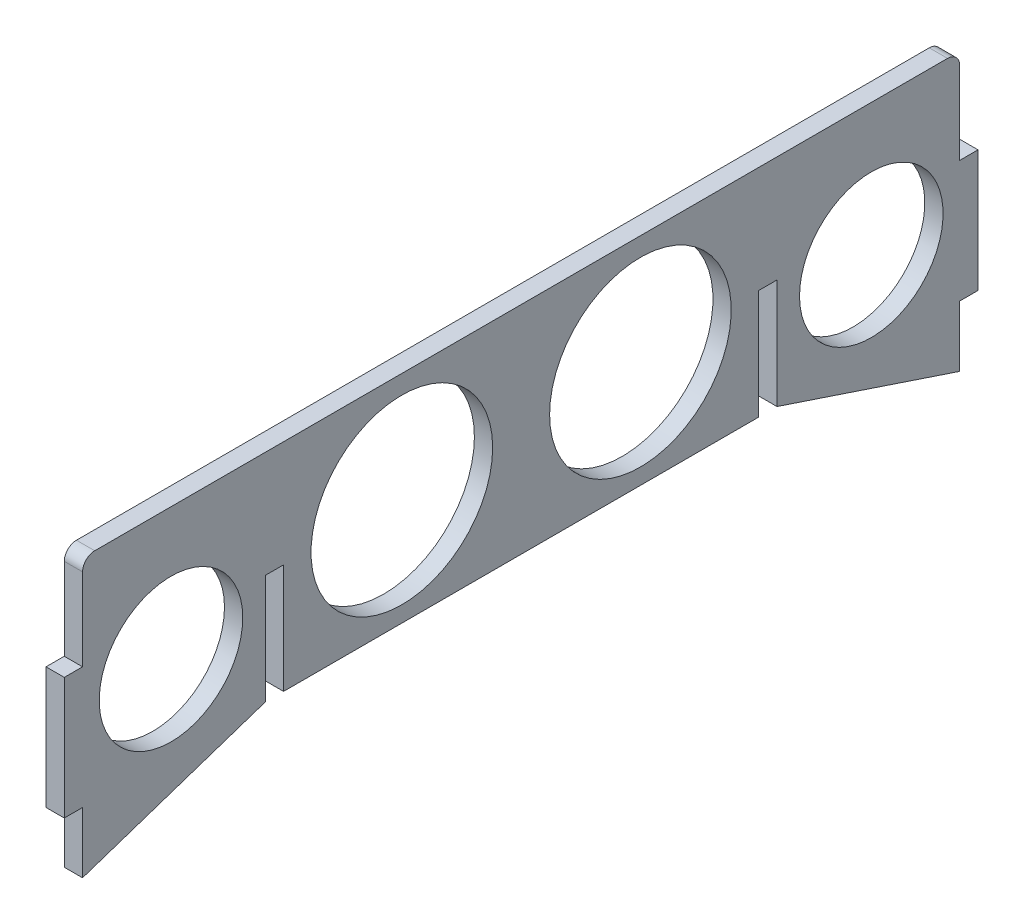
ISO-10303-21;
HEADER;
FILE_DESCRIPTION(('STEP AP214'),'2;1');
FILE_NAME('part.step','',(''),(''),'','','');
FILE_SCHEMA(('AUTOMOTIVE_DESIGN { 1 0 10303 214 1 1 1 1 }'));
ENDSEC;
DATA;
#1=APPLICATION_CONTEXT('core data for automotive mechanical design processes');
#2=APPLICATION_PROTOCOL_DEFINITION('international standard','automotive_design',2000,#1);
#3=PRODUCT_CONTEXT('',#1,'mechanical');
#4=PRODUCT('Part','Part','',(#3));
#5=PRODUCT_RELATED_PRODUCT_CATEGORY('part','',(#4));
#6=PRODUCT_DEFINITION_FORMATION('','',#4);
#7=PRODUCT_DEFINITION_CONTEXT('part definition',#1,'design');
#8=PRODUCT_DEFINITION('design','',#6,#7);
#9=PRODUCT_DEFINITION_SHAPE('','',#8);
#10=(LENGTH_UNIT() NAMED_UNIT(*) SI_UNIT(.MILLI.,.METRE.));
#11=(NAMED_UNIT(*) PLANE_ANGLE_UNIT() SI_UNIT($,.RADIAN.));
#12=(NAMED_UNIT(*) SI_UNIT($,.STERADIAN.) SOLID_ANGLE_UNIT());
#13=UNCERTAINTY_MEASURE_WITH_UNIT(LENGTH_MEASURE(1.E-05),#10,'distance_accuracy_value','');
#14=(GEOMETRIC_REPRESENTATION_CONTEXT(3) GLOBAL_UNCERTAINTY_ASSIGNED_CONTEXT((#13)) GLOBAL_UNIT_ASSIGNED_CONTEXT((#10,
#11,#12)) REPRESENTATION_CONTEXT('',''));
#15=CARTESIAN_POINT('',(0.,0.,0.));
#16=DIRECTION('',(0.,0.,1.));
#17=DIRECTION('',(1.,0.,0.));
#18=AXIS2_PLACEMENT_3D('',#15,#16,#17);
#19=CARTESIAN_POINT('',(3.,-17.75,-72.));
#20=DIRECTION('',(0.,0.,1.));
#21=DIRECTION('',(1.,0.,0.));
#22=AXIS2_PLACEMENT_3D('',#19,#20,#21);
#23=PLANE('',#22);
#24=DIRECTION('',(0.,1.,0.));
#25=VECTOR('',#24,1.);
#26=CARTESIAN_POINT('',(0.,-17.75,-72.));
#27=LINE('',#26,#25);
#28=CARTESIAN_POINT('',(0.,-27.75,-72.));
#29=VERTEX_POINT('',#28);
#30=CARTESIAN_POINT('',(0.,-17.75,-72.));
#31=VERTEX_POINT('',#30);
#32=EDGE_CURVE('E333',#29,#31,#27,.T.);
#33=ORIENTED_EDGE('',*,*,#32,.T.);
#34=DIRECTION('',(1.,0.,0.));
#35=VECTOR('',#34,1.);
#36=CARTESIAN_POINT('',(-20.2237484161567,-17.75,-72.));
#37=LINE('',#36,#35);
#38=CARTESIAN_POINT('',(3.,-17.75,-72.));
#39=VERTEX_POINT('',#38);
#40=EDGE_CURVE('E62',#31,#39,#37,.T.);
#41=ORIENTED_EDGE('',*,*,#40,.T.);
#42=DIRECTION('',(0.,1.,0.));
#43=VECTOR('',#42,1.);
#44=CARTESIAN_POINT('',(3.,-17.75,-72.));
#45=LINE('',#44,#43);
#46=CARTESIAN_POINT('',(3.,-27.75,-72.));
#47=VERTEX_POINT('',#46);
#48=EDGE_CURVE('E320',#47,#39,#45,.T.);
#49=ORIENTED_EDGE('',*,*,#48,.F.);
#50=DIRECTION('',(1.,0.,0.));
#51=VECTOR('',#50,1.);
#52=CARTESIAN_POINT('',(0.,-27.75,-72.));
#53=LINE('',#52,#51);
#54=EDGE_CURVE('E255',#29,#47,#53,.T.);
#55=ORIENTED_EDGE('',*,*,#54,.F.);
#56=EDGE_LOOP('',(#33,#41,#49,#55));
#57=FACE_BOUND('',#56,.T.);
#58=ADVANCED_FACE('F37',(#57),#23,.F.);
#59=CARTESIAN_POINT('',(3.,-17.75,72.));
#60=DIRECTION('',(0.,0.,-1.));
#61=DIRECTION('',(-1.,0.,0.));
#62=AXIS2_PLACEMENT_3D('',#59,#60,#61);
#63=PLANE('',#62);
#64=DIRECTION('',(0.,-1.,0.));
#65=VECTOR('',#64,1.);
#66=CARTESIAN_POINT('',(0.,-17.75,72.));
#67=LINE('',#66,#65);
#68=CARTESIAN_POINT('',(0.,15.75,72.));
#69=VERTEX_POINT('',#68);
#70=CARTESIAN_POINT('',(0.,2.25,72.));
#71=VERTEX_POINT('',#70);
#72=EDGE_CURVE('E339',#69,#71,#67,.T.);
#73=ORIENTED_EDGE('',*,*,#72,.T.);
#74=DIRECTION('',(1.,0.,0.));
#75=VECTOR('',#74,1.);
#76=CARTESIAN_POINT('',(-20.2237484161567,2.25,72.));
#77=LINE('',#76,#75);
#78=CARTESIAN_POINT('',(3.,2.25,72.));
#79=VERTEX_POINT('',#78);
#80=EDGE_CURVE('E248',#71,#79,#77,.T.);
#81=ORIENTED_EDGE('',*,*,#80,.T.);
#82=DIRECTION('',(0.,-1.,0.));
#83=VECTOR('',#82,1.);
#84=CARTESIAN_POINT('',(3.,-17.75,72.));
#85=LINE('',#84,#83);
#86=CARTESIAN_POINT('',(3.,15.75,72.));
#87=VERTEX_POINT('',#86);
#88=EDGE_CURVE('E326',#87,#79,#85,.T.);
#89=ORIENTED_EDGE('',*,*,#88,.F.);
#90=DIRECTION('',(-1.,0.,0.));
#91=VECTOR('',#90,1.);
#92=CARTESIAN_POINT('',(3.,15.75,72.));
#93=LINE('',#92,#91);
#94=EDGE_CURVE('E11',#87,#69,#93,.T.);
#95=ORIENTED_EDGE('',*,*,#94,.T.);
#96=EDGE_LOOP('',(#73,#81,#89,#95));
#97=FACE_BOUND('',#96,.T.);
#98=ADVANCED_FACE('F471',(#97),#63,.F.);
#99=CARTESIAN_POINT('',(3.,2.25,-72.));
#100=VERTEX_POINT('',#99);
#101=CARTESIAN_POINT('',(3.,15.75,-72.));
#102=VERTEX_POINT('',#101);
#103=EDGE_CURVE('E54',#100,#102,#45,.T.);
#104=ORIENTED_EDGE('',*,*,#103,.F.);
#105=DIRECTION('',(1.,0.,0.));
#106=VECTOR('',#105,1.);
#107=CARTESIAN_POINT('',(-20.2237484161567,2.25,-72.));
#108=LINE('',#107,#106);
#109=CARTESIAN_POINT('',(0.,2.25,-72.));
#110=VERTEX_POINT('',#109);
#111=EDGE_CURVE('E200',#110,#100,#108,.T.);
#112=ORIENTED_EDGE('',*,*,#111,.F.);
#113=CARTESIAN_POINT('',(0.,15.75,-72.));
#114=VERTEX_POINT('',#113);
#115=EDGE_CURVE('E197',#110,#114,#27,.T.);
#116=ORIENTED_EDGE('',*,*,#115,.T.);
#117=DIRECTION('',(-1.,0.,0.));
#118=VECTOR('',#117,1.);
#119=CARTESIAN_POINT('',(3.,15.75,-72.));
#120=LINE('',#119,#118);
#121=EDGE_CURVE('E352',#114,#102,#120,.F.);
#122=ORIENTED_EDGE('',*,*,#121,.T.);
#123=EDGE_LOOP('',(#104,#112,#116,#122));
#124=FACE_BOUND('',#123,.T.);
#125=ADVANCED_FACE('F461',(#124),#23,.F.);
#126=CARTESIAN_POINT('',(3.,17.75,72.));
#127=DIRECTION('',(0.,-1.,0.));
#128=DIRECTION('',(0.,0.,-1.));
#129=AXIS2_PLACEMENT_3D('',#126,#127,#128);
#130=PLANE('',#129);
#131=DIRECTION('',(0.,0.,1.));
#132=VECTOR('',#131,1.);
#133=CARTESIAN_POINT('',(3.,17.75,72.));
#134=LINE('',#133,#132);
#135=CARTESIAN_POINT('',(3.,17.75,-70.));
#136=VERTEX_POINT('',#135);
#137=CARTESIAN_POINT('',(3.,17.75,70.));
#138=VERTEX_POINT('',#137);
#139=EDGE_CURVE('E322',#136,#138,#134,.T.);
#140=ORIENTED_EDGE('',*,*,#139,.F.);
#141=DIRECTION('',(-1.,0.,0.));
#142=VECTOR('',#141,1.);
#143=CARTESIAN_POINT('',(3.,17.75,-70.));
#144=LINE('',#143,#142);
#145=CARTESIAN_POINT('',(0.,17.75,-70.));
#146=VERTEX_POINT('',#145);
#147=EDGE_CURVE('E345',#136,#146,#144,.T.);
#148=ORIENTED_EDGE('',*,*,#147,.T.);
#149=DIRECTION('',(0.,0.,1.));
#150=VECTOR('',#149,1.);
#151=CARTESIAN_POINT('',(0.,17.75,72.));
#152=LINE('',#151,#150);
#153=CARTESIAN_POINT('',(0.,17.75,70.));
#154=VERTEX_POINT('',#153);
#155=EDGE_CURVE('E335',#146,#154,#152,.T.);
#156=ORIENTED_EDGE('',*,*,#155,.T.);
#157=DIRECTION('',(-1.,0.,0.));
#158=VECTOR('',#157,1.);
#159=CARTESIAN_POINT('',(3.,17.75,70.));
#160=LINE('',#159,#158);
#161=EDGE_CURVE('E332',#154,#138,#160,.F.);
#162=ORIENTED_EDGE('',*,*,#161,.T.);
#163=EDGE_LOOP('',(#140,#148,#156,#162));
#164=FACE_BOUND('',#163,.T.);
#165=ADVANCED_FACE('F467',(#164),#130,.F.);
#166=CARTESIAN_POINT('',(3.,-17.75,72.));
#167=VERTEX_POINT('',#166);
#168=CARTESIAN_POINT('',(3.,-27.75,72.));
#169=VERTEX_POINT('',#168);
#170=EDGE_CURVE('E325',#167,#169,#85,.T.);
#171=ORIENTED_EDGE('',*,*,#170,.F.);
#172=DIRECTION('',(1.,0.,0.));
#173=VECTOR('',#172,1.);
#174=CARTESIAN_POINT('',(-20.2237484161567,-17.75,72.));
#175=LINE('',#174,#173);
#176=CARTESIAN_POINT('',(0.,-17.75,72.));
#177=VERTEX_POINT('',#176);
#178=EDGE_CURVE('E241',#177,#167,#175,.T.);
#179=ORIENTED_EDGE('',*,*,#178,.F.);
#180=CARTESIAN_POINT('',(0.,-27.75,72.));
#181=VERTEX_POINT('',#180);
#182=EDGE_CURVE('E338',#177,#181,#67,.T.);
#183=ORIENTED_EDGE('',*,*,#182,.T.);
#184=DIRECTION('',(1.,0.,0.));
#185=VECTOR('',#184,1.);
#186=CARTESIAN_POINT('',(0.,-27.75,72.));
#187=LINE('',#186,#185);
#188=EDGE_CURVE('E263',#181,#169,#187,.T.);
#189=ORIENTED_EDGE('',*,*,#188,.T.);
#190=EDGE_LOOP('',(#171,#179,#183,#189));
#191=FACE_BOUND('',#190,.T.);
#192=ADVANCED_FACE('F416',(#191),#63,.F.);
#193=CARTESIAN_POINT('',(3.,-17.75,72.));
#194=DIRECTION('',(0.,1.,0.));
#195=DIRECTION('',(0.,0.,1.));
#196=AXIS2_PLACEMENT_3D('',#193,#194,#195);
#197=PLANE('',#196);
#198=DIRECTION('',(0.,0.,-1.));
#199=VECTOR('',#198,1.);
#200=CARTESIAN_POINT('',(3.,-17.75,72.));
#201=LINE('',#200,#199);
#202=CARTESIAN_POINT('',(3.,-17.75,39.));
#203=VERTEX_POINT('',#202);
#204=CARTESIAN_POINT('',(3.,-17.75,-39.));
#205=VERTEX_POINT('',#204);
#206=EDGE_CURVE('E329',#203,#205,#201,.T.);
#207=ORIENTED_EDGE('',*,*,#206,.F.);
#208=DIRECTION('',(1.,0.,0.));
#209=VECTOR('',#208,1.);
#210=CARTESIAN_POINT('',(0.,-17.75,39.));
#211=LINE('',#210,#209);
#212=CARTESIAN_POINT('',(0.,-17.75,39.));
#213=VERTEX_POINT('',#212);
#214=EDGE_CURVE('E291',#213,#203,#211,.T.);
#215=ORIENTED_EDGE('',*,*,#214,.F.);
#216=DIRECTION('',(0.,0.,-1.));
#217=VECTOR('',#216,1.);
#218=CARTESIAN_POINT('',(0.,-17.75,72.));
#219=LINE('',#218,#217);
#220=CARTESIAN_POINT('',(0.,-17.75,-39.));
#221=VERTEX_POINT('',#220);
#222=EDGE_CURVE('E341',#213,#221,#219,.T.);
#223=ORIENTED_EDGE('',*,*,#222,.T.);
#224=DIRECTION('',(1.,0.,0.));
#225=VECTOR('',#224,1.);
#226=CARTESIAN_POINT('',(0.,-17.75,-39.));
#227=LINE('',#226,#225);
#228=EDGE_CURVE('E300',#221,#205,#227,.T.);
#229=ORIENTED_EDGE('',*,*,#228,.T.);
#230=EDGE_LOOP('',(#207,#215,#223,#229));
#231=FACE_BOUND('',#230,.T.);
#232=ADVANCED_FACE('F389',(#231),#197,.F.);
#233=CARTESIAN_POINT('',(3.,0.,0.));
#234=DIRECTION('',(-1.,0.,0.));
#235=DIRECTION('',(0.,0.,1.));
#236=AXIS2_PLACEMENT_3D('',#233,#234,#235);
#237=PLANE('',#236);
#238=CARTESIAN_POINT('',(3.,-3.90891223218621,57.4830976621887));
#239=DIRECTION('',(1.,0.,0.));
#240=DIRECTION('',(0.,0.,-1.));
#241=AXIS2_PLACEMENT_3D('',#238,#239,#240);
#242=CIRCLE('',#241,11.7827627714572);
#243=CARTESIAN_POINT('',(3.,-3.90891223218621,45.7003348907314));
#244=VERTEX_POINT('',#243);
#245=EDGE_CURVE('E361',#244,#244,#242,.T.);
#246=ORIENTED_EDGE('',*,*,#245,.F.);
#247=EDGE_LOOP('',(#246));
#248=FACE_BOUND('',#247,.T.);
#249=CARTESIAN_POINT('',(3.,-0.233669224813505,-19.5821541486577));
#250=DIRECTION('',(1.,0.,0.));
#251=DIRECTION('',(0.,0.,1.));
#252=AXIS2_PLACEMENT_3D('',#249,#250,#251);
#253=CIRCLE('',#252,14.908571559933);
#254=CARTESIAN_POINT('',(3.,-0.233669224813505,-4.67358258872468));
#255=VERTEX_POINT('',#254);
#256=EDGE_CURVE('E376',#255,#255,#253,.T.);
#257=ORIENTED_EDGE('',*,*,#256,.F.);
#258=EDGE_LOOP('',(#257));
#259=FACE_BOUND('',#258,.T.);
#260=CARTESIAN_POINT('',(3.,-3.90891223218621,-57.4830976621887));
#261=DIRECTION('',(1.,0.,0.));
#262=DIRECTION('',(0.,0.,1.));
#263=AXIS2_PLACEMENT_3D('',#260,#261,#262);
#264=CIRCLE('',#263,11.7827627714573);
#265=CARTESIAN_POINT('',(3.,-3.90891223218621,-45.7003348907314));
#266=VERTEX_POINT('',#265);
#267=EDGE_CURVE('E372',#266,#266,#264,.T.);
#268=ORIENTED_EDGE('',*,*,#267,.F.);
#269=EDGE_LOOP('',(#268));
#270=FACE_BOUND('',#269,.T.);
#271=CARTESIAN_POINT('',(3.,-0.233669224813505,19.5821541486577));
#272=DIRECTION('',(1.,0.,0.));
#273=DIRECTION('',(0.,0.,-1.));
#274=AXIS2_PLACEMENT_3D('',#271,#272,#273);
#275=CIRCLE('',#274,14.908571559933);
#276=CARTESIAN_POINT('',(3.,-0.233669224813505,4.67358258872468));
#277=VERTEX_POINT('',#276);
#278=EDGE_CURVE('E375',#277,#277,#275,.T.);
#279=ORIENTED_EDGE('',*,*,#278,.F.);
#280=EDGE_LOOP('',(#279));
#281=FACE_BOUND('',#280,.T.);
#282=ORIENTED_EDGE('',*,*,#88,.T.);
#283=DIRECTION('',(0.,0.,1.));
#284=VECTOR('',#283,1.);
#285=CARTESIAN_POINT('',(3.,2.25,72.));
#286=LINE('',#285,#284);
#287=CARTESIAN_POINT('',(3.,2.25,75.));
#288=VERTEX_POINT('',#287);
#289=EDGE_CURVE('E222',#79,#288,#286,.T.);
#290=ORIENTED_EDGE('',*,*,#289,.T.);
#291=DIRECTION('',(0.,-1.,0.));
#292=VECTOR('',#291,1.);
#293=CARTESIAN_POINT('',(3.,-17.75,75.));
#294=LINE('',#293,#292);
#295=CARTESIAN_POINT('',(3.,-17.75,75.));
#296=VERTEX_POINT('',#295);
#297=EDGE_CURVE('E230',#288,#296,#294,.T.);
#298=ORIENTED_EDGE('',*,*,#297,.T.);
#299=DIRECTION('',(0.,0.,-1.));
#300=VECTOR('',#299,1.);
#301=CARTESIAN_POINT('',(3.,-17.75,72.));
#302=LINE('',#301,#300);
#303=EDGE_CURVE('E226',#296,#167,#302,.T.);
#304=ORIENTED_EDGE('',*,*,#303,.T.);
#305=ORIENTED_EDGE('',*,*,#170,.T.);
#306=DIRECTION('',(0.,0.316227766016838,-0.948683298050514));
#307=VECTOR('',#306,1.);
#308=CARTESIAN_POINT('',(3.,-27.75,72.));
#309=LINE('',#308,#307);
#310=CARTESIAN_POINT('',(3.,-17.75,42.));
#311=VERTEX_POINT('',#310);
#312=EDGE_CURVE('E259',#169,#311,#309,.T.);
#313=ORIENTED_EDGE('',*,*,#312,.T.);
#314=DIRECTION('',(0.,-1.,0.));
#315=VECTOR('',#314,1.);
#316=CARTESIAN_POINT('',(3.,-17.75,42.));
#317=LINE('',#316,#315);
#318=CARTESIAN_POINT('',(3.,0.25,42.));
#319=VERTEX_POINT('',#318);
#320=EDGE_CURVE('E279',#319,#311,#317,.T.);
#321=ORIENTED_EDGE('',*,*,#320,.F.);
#322=DIRECTION('',(0.,0.,1.));
#323=VECTOR('',#322,1.);
#324=CARTESIAN_POINT('',(3.,0.25,42.));
#325=LINE('',#324,#323);
#326=CARTESIAN_POINT('',(3.,0.25,39.));
#327=VERTEX_POINT('',#326);
#328=EDGE_CURVE('E272',#327,#319,#325,.T.);
#329=ORIENTED_EDGE('',*,*,#328,.F.);
#330=DIRECTION('',(0.,1.,0.));
#331=VECTOR('',#330,1.);
#332=CARTESIAN_POINT('',(3.,-17.75,39.));
#333=LINE('',#332,#331);
#334=EDGE_CURVE('E281',#203,#327,#333,.T.);
#335=ORIENTED_EDGE('',*,*,#334,.F.);
#336=ORIENTED_EDGE('',*,*,#206,.T.);
#337=DIRECTION('',(0.,-1.,0.));
#338=VECTOR('',#337,1.);
#339=CARTESIAN_POINT('',(3.,-17.75,-39.));
#340=LINE('',#339,#338);
#341=CARTESIAN_POINT('',(3.,0.25,-39.));
#342=VERTEX_POINT('',#341);
#343=EDGE_CURVE('E305',#342,#205,#340,.T.);
#344=ORIENTED_EDGE('',*,*,#343,.F.);
#345=DIRECTION('',(0.,0.,1.));
#346=VECTOR('',#345,1.);
#347=CARTESIAN_POINT('',(3.,0.25,-42.));
#348=LINE('',#347,#346);
#349=CARTESIAN_POINT('',(3.,0.25,-42.));
#350=VERTEX_POINT('',#349);
#351=EDGE_CURVE('E307',#350,#342,#348,.T.);
#352=ORIENTED_EDGE('',*,*,#351,.F.);
#353=DIRECTION('',(0.,1.,0.));
#354=VECTOR('',#353,1.);
#355=CARTESIAN_POINT('',(3.,-17.75,-42.));
#356=LINE('',#355,#354);
#357=CARTESIAN_POINT('',(3.,-17.75,-42.));
#358=VERTEX_POINT('',#357);
#359=EDGE_CURVE('E282',#358,#350,#356,.T.);
#360=ORIENTED_EDGE('',*,*,#359,.F.);
#361=DIRECTION('',(0.,0.316227766016838,0.948683298050514));
#362=VECTOR('',#361,1.);
#363=CARTESIAN_POINT('',(3.,-27.75,-72.));
#364=LINE('',#363,#362);
#365=EDGE_CURVE('E252',#47,#358,#364,.T.);
#366=ORIENTED_EDGE('',*,*,#365,.F.);
#367=ORIENTED_EDGE('',*,*,#48,.T.);
#368=DIRECTION('',(0.,0.,-1.));
#369=VECTOR('',#368,1.);
#370=CARTESIAN_POINT('',(3.,-17.75,-72.));
#371=LINE('',#370,#369);
#372=CARTESIAN_POINT('',(3.,-17.75,-75.));
#373=VERTEX_POINT('',#372);
#374=EDGE_CURVE('E219',#39,#373,#371,.T.);
#375=ORIENTED_EDGE('',*,*,#374,.T.);
#376=DIRECTION('',(0.,1.,0.));
#377=VECTOR('',#376,1.);
#378=CARTESIAN_POINT('',(3.,-17.75,-75.));
#379=LINE('',#378,#377);
#380=CARTESIAN_POINT('',(3.,2.25,-75.));
#381=VERTEX_POINT('',#380);
#382=EDGE_CURVE('E223',#373,#381,#379,.T.);
#383=ORIENTED_EDGE('',*,*,#382,.T.);
#384=DIRECTION('',(0.,0.,1.));
#385=VECTOR('',#384,1.);
#386=CARTESIAN_POINT('',(3.,2.25,-72.));
#387=LINE('',#386,#385);
#388=EDGE_CURVE('E205',#381,#100,#387,.T.);
#389=ORIENTED_EDGE('',*,*,#388,.T.);
#390=ORIENTED_EDGE('',*,*,#103,.T.);
#391=CARTESIAN_POINT('',(3.,15.75,-70.));
#392=DIRECTION('',(-1.,0.,0.));
#393=DIRECTION('',(0.,0.,1.));
#394=AXIS2_PLACEMENT_3D('',#391,#392,#393);
#395=CIRCLE('',#394,2.);
#396=EDGE_CURVE('E46',#102,#136,#395,.F.);
#397=ORIENTED_EDGE('',*,*,#396,.T.);
#398=ORIENTED_EDGE('',*,*,#139,.T.);
#399=CARTESIAN_POINT('',(3.,15.75,70.));
#400=DIRECTION('',(-1.,0.,0.));
#401=DIRECTION('',(0.,0.,1.));
#402=AXIS2_PLACEMENT_3D('',#399,#400,#401);
#403=CIRCLE('',#402,2.);
#404=EDGE_CURVE('E354',#138,#87,#403,.F.);
#405=ORIENTED_EDGE('',*,*,#404,.T.);
#406=EDGE_LOOP('',(#282,#290,#298,#304,#305,#313,#321,#329,#335,#336,#344,#352,#360,#366,#367,
#375,#383,#389,#390,#397,#398,#405));
#407=FACE_BOUND('',#406,.T.);
#408=ADVANCED_FACE('F386',(#248,#259,#270,#281,#407),#237,.F.);
#409=CARTESIAN_POINT('',(0.,0.,0.));
#410=DIRECTION('',(-1.,0.,0.));
#411=DIRECTION('',(0.,0.,1.));
#412=AXIS2_PLACEMENT_3D('',#409,#410,#411);
#413=PLANE('',#412);
#414=CARTESIAN_POINT('',(0.,-3.90891223218621,57.4830976621887));
#415=DIRECTION('',(-1.,0.,0.));
#416=DIRECTION('',(0.,0.,1.));
#417=AXIS2_PLACEMENT_3D('',#414,#415,#416);
#418=CIRCLE('',#417,11.7827627714572);
#419=CARTESIAN_POINT('',(0.,-3.90891223218621,69.2658604336459));
#420=VERTEX_POINT('',#419);
#421=EDGE_CURVE('E41',#420,#420,#418,.T.);
#422=ORIENTED_EDGE('',*,*,#421,.F.);
#423=EDGE_LOOP('',(#422));
#424=FACE_BOUND('',#423,.T.);
#425=CARTESIAN_POINT('',(0.,-0.233669224813505,-19.5821541486577));
#426=DIRECTION('',(-1.,0.,0.));
#427=DIRECTION('',(0.,0.,1.));
#428=AXIS2_PLACEMENT_3D('',#425,#426,#427);
#429=CIRCLE('',#428,14.908571559933);
#430=CARTESIAN_POINT('',(0.,-0.233669224813505,-4.67358258872468));
#431=VERTEX_POINT('',#430);
#432=EDGE_CURVE('E363',#431,#431,#429,.T.);
#433=ORIENTED_EDGE('',*,*,#432,.F.);
#434=EDGE_LOOP('',(#433));
#435=FACE_BOUND('',#434,.T.);
#436=CARTESIAN_POINT('',(0.,-3.90891223218621,-57.4830976621887));
#437=DIRECTION('',(-1.,0.,0.));
#438=DIRECTION('',(0.,0.,1.));
#439=AXIS2_PLACEMENT_3D('',#436,#437,#438);
#440=CIRCLE('',#439,11.7827627714573);
#441=CARTESIAN_POINT('',(0.,-3.90891223218621,-45.7003348907314));
#442=VERTEX_POINT('',#441);
#443=EDGE_CURVE('E360',#442,#442,#440,.T.);
#444=ORIENTED_EDGE('',*,*,#443,.F.);
#445=EDGE_LOOP('',(#444));
#446=FACE_BOUND('',#445,.T.);
#447=CARTESIAN_POINT('',(0.,-0.233669224813505,19.5821541486577));
#448=DIRECTION('',(-1.,0.,0.));
#449=DIRECTION('',(0.,0.,1.));
#450=AXIS2_PLACEMENT_3D('',#447,#448,#449);
#451=CIRCLE('',#450,14.908571559933);
#452=CARTESIAN_POINT('',(0.,-0.233669224813505,34.4907257085907));
#453=VERTEX_POINT('',#452);
#454=EDGE_CURVE('E357',#453,#453,#451,.T.);
#455=ORIENTED_EDGE('',*,*,#454,.F.);
#456=EDGE_LOOP('',(#455));
#457=FACE_BOUND('',#456,.T.);
#458=DIRECTION('',(0.,-1.,0.));
#459=VECTOR('',#458,1.);
#460=CARTESIAN_POINT('',(0.,-17.75,42.));
#461=LINE('',#460,#459);
#462=CARTESIAN_POINT('',(0.,0.25,42.));
#463=VERTEX_POINT('',#462);
#464=CARTESIAN_POINT('',(0.,-17.75,42.));
#465=VERTEX_POINT('',#464);
#466=EDGE_CURVE('E269',#463,#465,#461,.T.);
#467=ORIENTED_EDGE('',*,*,#466,.T.);
#468=DIRECTION('',(0.,0.316227766016838,-0.948683298050514));
#469=VECTOR('',#468,1.);
#470=CARTESIAN_POINT('',(0.,-27.75,72.));
#471=LINE('',#470,#469);
#472=EDGE_CURVE('E260',#181,#465,#471,.T.);
#473=ORIENTED_EDGE('',*,*,#472,.F.);
#474=ORIENTED_EDGE('',*,*,#182,.F.);
#475=DIRECTION('',(0.,0.,-1.));
#476=VECTOR('',#475,1.);
#477=CARTESIAN_POINT('',(0.,-17.75,72.));
#478=LINE('',#477,#476);
#479=CARTESIAN_POINT('',(0.,-17.75,75.));
#480=VERTEX_POINT('',#479);
#481=EDGE_CURVE('E238',#480,#177,#478,.T.);
#482=ORIENTED_EDGE('',*,*,#481,.F.);
#483=DIRECTION('',(0.,-1.,0.));
#484=VECTOR('',#483,1.);
#485=CARTESIAN_POINT('',(0.,-17.75,75.));
#486=LINE('',#485,#484);
#487=CARTESIAN_POINT('',(0.,2.25,75.));
#488=VERTEX_POINT('',#487);
#489=EDGE_CURVE('E243',#488,#480,#486,.T.);
#490=ORIENTED_EDGE('',*,*,#489,.F.);
#491=DIRECTION('',(0.,0.,1.));
#492=VECTOR('',#491,1.);
#493=CARTESIAN_POINT('',(0.,2.25,72.));
#494=LINE('',#493,#492);
#495=EDGE_CURVE('E229',#71,#488,#494,.T.);
#496=ORIENTED_EDGE('',*,*,#495,.F.);
#497=ORIENTED_EDGE('',*,*,#72,.F.);
#498=CARTESIAN_POINT('',(0.,15.75,70.));
#499=DIRECTION('',(-1.,0.,0.));
#500=DIRECTION('',(0.,0.,1.));
#501=AXIS2_PLACEMENT_3D('',#498,#499,#500);
#502=CIRCLE('',#501,2.);
#503=EDGE_CURVE('E348',#69,#154,#502,.T.);
#504=ORIENTED_EDGE('',*,*,#503,.T.);
#505=ORIENTED_EDGE('',*,*,#155,.F.);
#506=CARTESIAN_POINT('',(0.,15.75,-70.));
#507=DIRECTION('',(-1.,0.,0.));
#508=DIRECTION('',(0.,0.,1.));
#509=AXIS2_PLACEMENT_3D('',#506,#507,#508);
#510=CIRCLE('',#509,2.);
#511=EDGE_CURVE('E350',#146,#114,#510,.T.);
#512=ORIENTED_EDGE('',*,*,#511,.T.);
#513=ORIENTED_EDGE('',*,*,#115,.F.);
#514=DIRECTION('',(0.,0.,1.));
#515=VECTOR('',#514,1.);
#516=CARTESIAN_POINT('',(0.,2.25,-72.));
#517=LINE('',#516,#515);
#518=CARTESIAN_POINT('',(0.,2.25,-75.));
#519=VERTEX_POINT('',#518);
#520=EDGE_CURVE('E188',#519,#110,#517,.T.);
#521=ORIENTED_EDGE('',*,*,#520,.F.);
#522=DIRECTION('',(0.,1.,0.));
#523=VECTOR('',#522,1.);
#524=CARTESIAN_POINT('',(0.,-17.75,-75.));
#525=LINE('',#524,#523);
#526=CARTESIAN_POINT('',(0.,-17.75,-75.));
#527=VERTEX_POINT('',#526);
#528=EDGE_CURVE('E194',#527,#519,#525,.T.);
#529=ORIENTED_EDGE('',*,*,#528,.F.);
#530=DIRECTION('',(0.,0.,-1.));
#531=VECTOR('',#530,1.);
#532=CARTESIAN_POINT('',(0.,-17.75,-72.));
#533=LINE('',#532,#531);
#534=EDGE_CURVE('E214',#31,#527,#533,.T.);
#535=ORIENTED_EDGE('',*,*,#534,.F.);
#536=ORIENTED_EDGE('',*,*,#32,.F.);
#537=DIRECTION('',(0.,0.316227766016838,0.948683298050514));
#538=VECTOR('',#537,1.);
#539=CARTESIAN_POINT('',(0.,-27.75,-72.));
#540=LINE('',#539,#538);
#541=CARTESIAN_POINT('',(0.,-17.75,-42.));
#542=VERTEX_POINT('',#541);
#543=EDGE_CURVE('E253',#29,#542,#540,.T.);
#544=ORIENTED_EDGE('',*,*,#543,.T.);
#545=DIRECTION('',(0.,1.,0.));
#546=VECTOR('',#545,1.);
#547=CARTESIAN_POINT('',(0.,-17.75,-42.));
#548=LINE('',#547,#546);
#549=CARTESIAN_POINT('',(0.,0.25,-42.));
#550=VERTEX_POINT('',#549);
#551=EDGE_CURVE('E308',#542,#550,#548,.T.);
#552=ORIENTED_EDGE('',*,*,#551,.T.);
#553=DIRECTION('',(0.,0.,1.));
#554=VECTOR('',#553,1.);
#555=CARTESIAN_POINT('',(0.,0.25,-42.));
#556=LINE('',#555,#554);
#557=CARTESIAN_POINT('',(0.,0.25,-39.));
#558=VERTEX_POINT('',#557);
#559=EDGE_CURVE('E315',#550,#558,#556,.T.);
#560=ORIENTED_EDGE('',*,*,#559,.T.);
#561=DIRECTION('',(0.,-1.,0.));
#562=VECTOR('',#561,1.);
#563=CARTESIAN_POINT('',(0.,-17.75,-39.));
#564=LINE('',#563,#562);
#565=EDGE_CURVE('E297',#558,#221,#564,.T.);
#566=ORIENTED_EDGE('',*,*,#565,.T.);
#567=ORIENTED_EDGE('',*,*,#222,.F.);
#568=DIRECTION('',(0.,1.,0.));
#569=VECTOR('',#568,1.);
#570=CARTESIAN_POINT('',(0.,-17.75,39.));
#571=LINE('',#570,#569);
#572=CARTESIAN_POINT('',(0.,0.25,39.));
#573=VERTEX_POINT('',#572);
#574=EDGE_CURVE('E271',#213,#573,#571,.T.);
#575=ORIENTED_EDGE('',*,*,#574,.T.);
#576=DIRECTION('',(0.,0.,1.));
#577=VECTOR('',#576,1.);
#578=CARTESIAN_POINT('',(0.,0.25,42.));
#579=LINE('',#578,#577);
#580=EDGE_CURVE('E275',#573,#463,#579,.T.);
#581=ORIENTED_EDGE('',*,*,#580,.T.);
#582=EDGE_LOOP('',(#467,#473,#474,#482,#490,#496,#497,#504,#505,#512,#513,#521,#529,#535,#536,
#544,#552,#560,#566,#567,#575,#581));
#583=FACE_BOUND('',#582,.T.);
#584=ADVANCED_FACE('F191',(#424,#435,#446,#457,#583),#413,.T.);
#585=CARTESIAN_POINT('',(3.,15.75,-70.));
#586=DIRECTION('',(-1.,0.,0.));
#587=DIRECTION('',(0.,0.,1.));
#588=AXIS2_PLACEMENT_3D('',#585,#586,#587);
#589=CYLINDRICAL_SURFACE('',#588,2.);
#590=ORIENTED_EDGE('',*,*,#396,.F.);
#591=ORIENTED_EDGE('',*,*,#121,.F.);
#592=ORIENTED_EDGE('',*,*,#511,.F.);
#593=ORIENTED_EDGE('',*,*,#147,.F.);
#594=EDGE_LOOP('',(#590,#591,#592,#593));
#595=FACE_BOUND('',#594,.T.);
#596=ADVANCED_FACE('F464',(#595),#589,.T.);
#597=CARTESIAN_POINT('',(3.,15.75,70.));
#598=DIRECTION('',(-1.,0.,0.));
#599=DIRECTION('',(0.,0.,1.));
#600=AXIS2_PLACEMENT_3D('',#597,#598,#599);
#601=CYLINDRICAL_SURFACE('',#600,2.);
#602=ORIENTED_EDGE('',*,*,#404,.F.);
#603=ORIENTED_EDGE('',*,*,#161,.F.);
#604=ORIENTED_EDGE('',*,*,#503,.F.);
#605=ORIENTED_EDGE('',*,*,#94,.F.);
#606=EDGE_LOOP('',(#602,#603,#604,#605));
#607=FACE_BOUND('',#606,.T.);
#608=ADVANCED_FACE('F39',(#607),#601,.T.);
#609=CARTESIAN_POINT('',(0.,-17.75,-42.));
#610=DIRECTION('',(0.,0.,-1.));
#611=DIRECTION('',(-1.,0.,0.));
#612=AXIS2_PLACEMENT_3D('',#609,#610,#611);
#613=PLANE('',#612);
#614=ORIENTED_EDGE('',*,*,#359,.T.);
#615=DIRECTION('',(1.,0.,0.));
#616=VECTOR('',#615,1.);
#617=CARTESIAN_POINT('',(0.,0.25,-42.));
#618=LINE('',#617,#616);
#619=EDGE_CURVE('E295',#550,#350,#618,.T.);
#620=ORIENTED_EDGE('',*,*,#619,.F.);
#621=ORIENTED_EDGE('',*,*,#551,.F.);
#622=DIRECTION('',(1.,0.,0.));
#623=VECTOR('',#622,1.);
#624=CARTESIAN_POINT('',(0.,-17.75,-42.));
#625=LINE('',#624,#623);
#626=EDGE_CURVE('E268',#542,#358,#625,.T.);
#627=ORIENTED_EDGE('',*,*,#626,.T.);
#628=EDGE_LOOP('',(#614,#620,#621,#627));
#629=FACE_BOUND('',#628,.T.);
#630=ADVANCED_FACE('F449',(#629),#613,.F.);
#631=CARTESIAN_POINT('',(0.,-17.75,-39.));
#632=DIRECTION('',(0.,0.,1.));
#633=DIRECTION('',(1.,0.,0.));
#634=AXIS2_PLACEMENT_3D('',#631,#632,#633);
#635=PLANE('',#634);
#636=ORIENTED_EDGE('',*,*,#343,.T.);
#637=ORIENTED_EDGE('',*,*,#228,.F.);
#638=ORIENTED_EDGE('',*,*,#565,.F.);
#639=DIRECTION('',(1.,0.,0.));
#640=VECTOR('',#639,1.);
#641=CARTESIAN_POINT('',(0.,0.25,-39.));
#642=LINE('',#641,#640);
#643=EDGE_CURVE('E298',#558,#342,#642,.T.);
#644=ORIENTED_EDGE('',*,*,#643,.T.);
#645=EDGE_LOOP('',(#636,#637,#638,#644));
#646=FACE_BOUND('',#645,.T.);
#647=ADVANCED_FACE('F439',(#646),#635,.F.);
#648=CARTESIAN_POINT('',(0.,0.25,-42.));
#649=DIRECTION('',(0.,1.,0.));
#650=DIRECTION('',(0.,0.,1.));
#651=AXIS2_PLACEMENT_3D('',#648,#649,#650);
#652=PLANE('',#651);
#653=ORIENTED_EDGE('',*,*,#351,.T.);
#654=ORIENTED_EDGE('',*,*,#643,.F.);
#655=ORIENTED_EDGE('',*,*,#559,.F.);
#656=ORIENTED_EDGE('',*,*,#619,.T.);
#657=EDGE_LOOP('',(#653,#654,#655,#656));
#658=FACE_BOUND('',#657,.T.);
#659=ADVANCED_FACE('F444',(#658),#652,.F.);
#660=CARTESIAN_POINT('',(0.,-17.75,42.));
#661=DIRECTION('',(0.,0.,1.));
#662=DIRECTION('',(1.,0.,0.));
#663=AXIS2_PLACEMENT_3D('',#660,#661,#662);
#664=PLANE('',#663);
#665=ORIENTED_EDGE('',*,*,#320,.T.);
#666=DIRECTION('',(1.,0.,0.));
#667=VECTOR('',#666,1.);
#668=CARTESIAN_POINT('',(0.,-17.75,42.));
#669=LINE('',#668,#667);
#670=EDGE_CURVE('E278',#465,#311,#669,.T.);
#671=ORIENTED_EDGE('',*,*,#670,.F.);
#672=ORIENTED_EDGE('',*,*,#466,.F.);
#673=DIRECTION('',(1.,0.,0.));
#674=VECTOR('',#673,1.);
#675=CARTESIAN_POINT('',(0.,0.25,42.));
#676=LINE('',#675,#674);
#677=EDGE_CURVE('E287',#463,#319,#676,.T.);
#678=ORIENTED_EDGE('',*,*,#677,.T.);
#679=EDGE_LOOP('',(#665,#671,#672,#678));
#680=FACE_BOUND('',#679,.T.);
#681=ADVANCED_FACE('F426',(#680),#664,.F.);
#682=CARTESIAN_POINT('',(0.,0.25,42.));
#683=DIRECTION('',(0.,1.,0.));
#684=DIRECTION('',(0.,0.,1.));
#685=AXIS2_PLACEMENT_3D('',#682,#683,#684);
#686=PLANE('',#685);
#687=ORIENTED_EDGE('',*,*,#328,.T.);
#688=ORIENTED_EDGE('',*,*,#677,.F.);
#689=ORIENTED_EDGE('',*,*,#580,.F.);
#690=DIRECTION('',(1.,0.,0.));
#691=VECTOR('',#690,1.);
#692=CARTESIAN_POINT('',(0.,0.25,39.));
#693=LINE('',#692,#691);
#694=EDGE_CURVE('E289',#573,#327,#693,.T.);
#695=ORIENTED_EDGE('',*,*,#694,.T.);
#696=EDGE_LOOP('',(#687,#688,#689,#695));
#697=FACE_BOUND('',#696,.T.);
#698=ADVANCED_FACE('F430',(#697),#686,.F.);
#699=CARTESIAN_POINT('',(0.,-17.75,39.));
#700=DIRECTION('',(0.,0.,-1.));
#701=DIRECTION('',(-1.,0.,0.));
#702=AXIS2_PLACEMENT_3D('',#699,#700,#701);
#703=PLANE('',#702);
#704=ORIENTED_EDGE('',*,*,#334,.T.);
#705=ORIENTED_EDGE('',*,*,#694,.F.);
#706=ORIENTED_EDGE('',*,*,#574,.F.);
#707=ORIENTED_EDGE('',*,*,#214,.T.);
#708=EDGE_LOOP('',(#704,#705,#706,#707));
#709=FACE_BOUND('',#708,.T.);
#710=ADVANCED_FACE('F432',(#709),#703,.F.);
#711=CARTESIAN_POINT('',(0.,-27.75,72.));
#712=DIRECTION('',(0.,-0.948683298050514,-0.316227766016838));
#713=DIRECTION('',(0.,0.316227766016838,-0.948683298050514));
#714=AXIS2_PLACEMENT_3D('',#711,#712,#713);
#715=PLANE('',#714);
#716=ORIENTED_EDGE('',*,*,#312,.F.);
#717=ORIENTED_EDGE('',*,*,#188,.F.);
#718=ORIENTED_EDGE('',*,*,#472,.T.);
#719=ORIENTED_EDGE('',*,*,#670,.T.);
#720=EDGE_LOOP('',(#716,#717,#718,#719));
#721=FACE_BOUND('',#720,.T.);
#722=ADVANCED_FACE('F422',(#721),#715,.T.);
#723=CARTESIAN_POINT('',(0.,-27.75,-72.));
#724=DIRECTION('',(0.,0.948683298050514,-0.316227766016838));
#725=DIRECTION('',(0.,0.316227766016838,0.948683298050514));
#726=AXIS2_PLACEMENT_3D('',#723,#724,#725);
#727=PLANE('',#726);
#728=ORIENTED_EDGE('',*,*,#365,.T.);
#729=ORIENTED_EDGE('',*,*,#626,.F.);
#730=ORIENTED_EDGE('',*,*,#543,.F.);
#731=ORIENTED_EDGE('',*,*,#54,.T.);
#732=EDGE_LOOP('',(#728,#729,#730,#731));
#733=FACE_BOUND('',#732,.T.);
#734=ADVANCED_FACE('F453',(#733),#727,.F.);
#735=CARTESIAN_POINT('',(-20.2237484161567,2.25,72.));
#736=DIRECTION('',(0.,1.,0.));
#737=DIRECTION('',(0.,0.,1.));
#738=AXIS2_PLACEMENT_3D('',#735,#736,#737);
#739=PLANE('',#738);
#740=ORIENTED_EDGE('',*,*,#80,.F.);
#741=ORIENTED_EDGE('',*,*,#495,.T.);
#742=DIRECTION('',(1.,0.,0.));
#743=VECTOR('',#742,1.);
#744=CARTESIAN_POINT('',(-20.2237484161567,2.25,75.));
#745=LINE('',#744,#743);
#746=EDGE_CURVE('E237',#488,#288,#745,.T.);
#747=ORIENTED_EDGE('',*,*,#746,.T.);
#748=ORIENTED_EDGE('',*,*,#289,.F.);
#749=EDGE_LOOP('',(#740,#741,#747,#748));
#750=FACE_BOUND('',#749,.T.);
#751=ADVANCED_FACE('F404',(#750),#739,.T.);
#752=CARTESIAN_POINT('',(-20.2237484161567,-17.75,75.));
#753=DIRECTION('',(0.,0.,1.));
#754=DIRECTION('',(1.,0.,0.));
#755=AXIS2_PLACEMENT_3D('',#752,#753,#754);
#756=PLANE('',#755);
#757=ORIENTED_EDGE('',*,*,#746,.F.);
#758=ORIENTED_EDGE('',*,*,#489,.T.);
#759=DIRECTION('',(1.,0.,0.));
#760=VECTOR('',#759,1.);
#761=CARTESIAN_POINT('',(-20.2237484161567,-17.75,75.));
#762=LINE('',#761,#760);
#763=EDGE_CURVE('E242',#480,#296,#762,.T.);
#764=ORIENTED_EDGE('',*,*,#763,.T.);
#765=ORIENTED_EDGE('',*,*,#297,.F.);
#766=EDGE_LOOP('',(#757,#758,#764,#765));
#767=FACE_BOUND('',#766,.T.);
#768=ADVANCED_FACE('F409',(#767),#756,.T.);
#769=CARTESIAN_POINT('',(-20.2237484161567,-17.75,72.));
#770=DIRECTION('',(0.,-1.,0.));
#771=DIRECTION('',(0.,0.,-1.));
#772=AXIS2_PLACEMENT_3D('',#769,#770,#771);
#773=PLANE('',#772);
#774=ORIENTED_EDGE('',*,*,#763,.F.);
#775=ORIENTED_EDGE('',*,*,#481,.T.);
#776=ORIENTED_EDGE('',*,*,#178,.T.);
#777=ORIENTED_EDGE('',*,*,#303,.F.);
#778=EDGE_LOOP('',(#774,#775,#776,#777));
#779=FACE_BOUND('',#778,.T.);
#780=ADVANCED_FACE('F413',(#779),#773,.T.);
#781=CARTESIAN_POINT('',(-20.2237484161567,-17.75,-72.));
#782=DIRECTION('',(0.,-1.,0.));
#783=DIRECTION('',(0.,0.,-1.));
#784=AXIS2_PLACEMENT_3D('',#781,#782,#783);
#785=PLANE('',#784);
#786=ORIENTED_EDGE('',*,*,#40,.F.);
#787=ORIENTED_EDGE('',*,*,#534,.T.);
#788=DIRECTION('',(1.,0.,0.));
#789=VECTOR('',#788,1.);
#790=CARTESIAN_POINT('',(-20.2237484161567,-17.75,-75.));
#791=LINE('',#790,#789);
#792=EDGE_CURVE('E211',#527,#373,#791,.T.);
#793=ORIENTED_EDGE('',*,*,#792,.T.);
#794=ORIENTED_EDGE('',*,*,#374,.F.);
#795=EDGE_LOOP('',(#786,#787,#793,#794));
#796=FACE_BOUND('',#795,.T.);
#797=ADVANCED_FACE('F457',(#796),#785,.T.);
#798=CARTESIAN_POINT('',(-20.2237484161567,-17.75,-75.));
#799=DIRECTION('',(0.,0.,-1.));
#800=DIRECTION('',(-1.,0.,0.));
#801=AXIS2_PLACEMENT_3D('',#798,#799,#800);
#802=PLANE('',#801);
#803=ORIENTED_EDGE('',*,*,#792,.F.);
#804=ORIENTED_EDGE('',*,*,#528,.T.);
#805=DIRECTION('',(1.,0.,0.));
#806=VECTOR('',#805,1.);
#807=CARTESIAN_POINT('',(-20.2237484161567,2.25,-75.));
#808=LINE('',#807,#806);
#809=EDGE_CURVE('E199',#519,#381,#808,.T.);
#810=ORIENTED_EDGE('',*,*,#809,.T.);
#811=ORIENTED_EDGE('',*,*,#382,.F.);
#812=EDGE_LOOP('',(#803,#804,#810,#811));
#813=FACE_BOUND('',#812,.T.);
#814=ADVANCED_FACE('F210',(#813),#802,.T.);
#815=CARTESIAN_POINT('',(-20.2237484161567,2.25,-72.));
#816=DIRECTION('',(0.,1.,0.));
#817=DIRECTION('',(0.,0.,1.));
#818=AXIS2_PLACEMENT_3D('',#815,#816,#817);
#819=PLANE('',#818);
#820=ORIENTED_EDGE('',*,*,#809,.F.);
#821=ORIENTED_EDGE('',*,*,#520,.T.);
#822=ORIENTED_EDGE('',*,*,#111,.T.);
#823=ORIENTED_EDGE('',*,*,#388,.F.);
#824=EDGE_LOOP('',(#820,#821,#822,#823));
#825=FACE_BOUND('',#824,.T.);
#826=ADVANCED_FACE('F203',(#825),#819,.T.);
#827=CARTESIAN_POINT('',(-7.,-0.233669224813505,19.5821541486577));
#828=DIRECTION('',(1.,0.,0.));
#829=DIRECTION('',(0.,0.,-1.));
#830=AXIS2_PLACEMENT_3D('',#827,#828,#829);
#831=CYLINDRICAL_SURFACE('',#830,14.908571559933);
#832=ORIENTED_EDGE('',*,*,#454,.T.);
#833=EDGE_LOOP('',(#832));
#834=FACE_BOUND('',#833,.T.);
#835=ORIENTED_EDGE('',*,*,#278,.T.);
#836=EDGE_LOOP('',(#835));
#837=FACE_BOUND('',#836,.T.);
#838=ADVANCED_FACE('F525',(#834,#837),#831,.F.);
#839=CARTESIAN_POINT('',(-7.,-3.90891223218621,-57.4830976621887));
#840=DIRECTION('',(1.,0.,0.));
#841=DIRECTION('',(0.,0.,-1.));
#842=AXIS2_PLACEMENT_3D('',#839,#840,#841);
#843=CYLINDRICAL_SURFACE('',#842,11.7827627714573);
#844=ORIENTED_EDGE('',*,*,#443,.T.);
#845=EDGE_LOOP('',(#844));
#846=FACE_BOUND('',#845,.T.);
#847=ORIENTED_EDGE('',*,*,#267,.T.);
#848=EDGE_LOOP('',(#847));
#849=FACE_BOUND('',#848,.T.);
#850=ADVANCED_FACE('F530',(#846,#849),#843,.F.);
#851=CARTESIAN_POINT('',(-7.,-0.233669224813505,-19.5821541486577));
#852=DIRECTION('',(1.,0.,0.));
#853=DIRECTION('',(0.,0.,-1.));
#854=AXIS2_PLACEMENT_3D('',#851,#852,#853);
#855=CYLINDRICAL_SURFACE('',#854,14.908571559933);
#856=ORIENTED_EDGE('',*,*,#432,.T.);
#857=EDGE_LOOP('',(#856));
#858=FACE_BOUND('',#857,.T.);
#859=ORIENTED_EDGE('',*,*,#256,.T.);
#860=EDGE_LOOP('',(#859));
#861=FACE_BOUND('',#860,.T.);
#862=ADVANCED_FACE('F533',(#858,#861),#855,.F.);
#863=CARTESIAN_POINT('',(-7.,-3.90891223218621,57.4830976621887));
#864=DIRECTION('',(1.,0.,0.));
#865=DIRECTION('',(0.,0.,-1.));
#866=AXIS2_PLACEMENT_3D('',#863,#864,#865);
#867=CYLINDRICAL_SURFACE('',#866,11.7827627714572);
#868=ORIENTED_EDGE('',*,*,#421,.T.);
#869=EDGE_LOOP('',(#868));
#870=FACE_BOUND('',#869,.T.);
#871=ORIENTED_EDGE('',*,*,#245,.T.);
#872=EDGE_LOOP('',(#871));
#873=FACE_BOUND('',#872,.T.);
#874=ADVANCED_FACE('F384',(#870,#873),#867,.F.);
#875=CLOSED_SHELL('',(#58,#98,#125,#165,#192,#232,#408,#584,#596,#608,#630,#647,#659,#681,#698,
#710,#722,#734,#751,#768,#780,#797,#814,#826,#838,#850,#862,#874));
#876=MANIFOLD_SOLID_BREP('B2',#875);
#877=ADVANCED_BREP_SHAPE_REPRESENTATION('',(#18,#876),#14);
#878=SHAPE_DEFINITION_REPRESENTATION(#9,#877);
ENDSEC;
END-ISO-10303-21;
